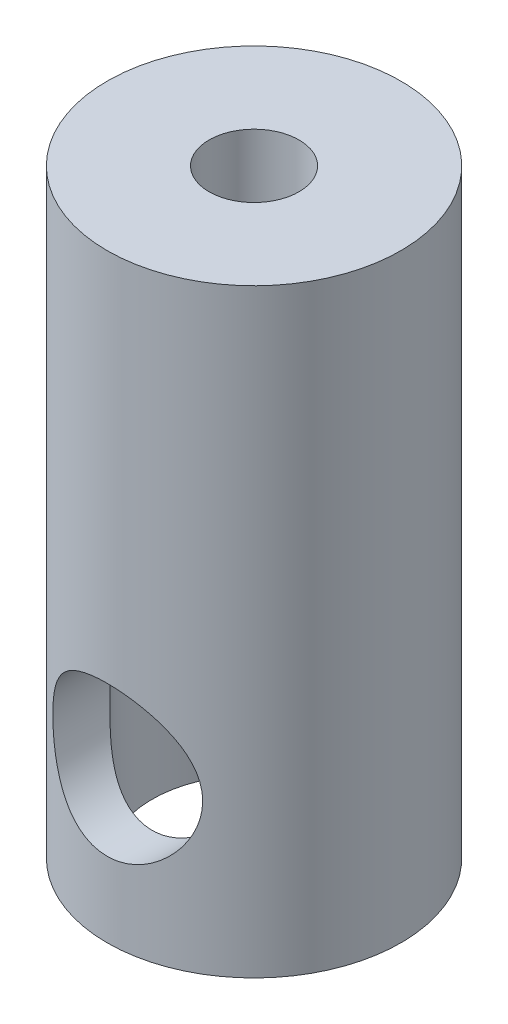
ISO-10303-21;
HEADER;
FILE_DESCRIPTION(('STEP AP214'),'2;1');
FILE_NAME('part.step','',(''),(''),'','','');
FILE_SCHEMA(('AUTOMOTIVE_DESIGN { 1 0 10303 214 1 1 1 1 }'));
ENDSEC;
DATA;
#1=APPLICATION_CONTEXT('core data for automotive mechanical design processes');
#2=APPLICATION_PROTOCOL_DEFINITION('international standard','automotive_design',2000,#1);
#3=PRODUCT_CONTEXT('',#1,'mechanical');
#4=PRODUCT('Part','Part','',(#3));
#5=PRODUCT_RELATED_PRODUCT_CATEGORY('part','',(#4));
#6=PRODUCT_DEFINITION_FORMATION('','',#4);
#7=PRODUCT_DEFINITION_CONTEXT('part definition',#1,'design');
#8=PRODUCT_DEFINITION('design','',#6,#7);
#9=PRODUCT_DEFINITION_SHAPE('','',#8);
#10=(LENGTH_UNIT() NAMED_UNIT(*) SI_UNIT(.MILLI.,.METRE.));
#11=(NAMED_UNIT(*) PLANE_ANGLE_UNIT() SI_UNIT($,.RADIAN.));
#12=(NAMED_UNIT(*) SI_UNIT($,.STERADIAN.) SOLID_ANGLE_UNIT());
#13=UNCERTAINTY_MEASURE_WITH_UNIT(LENGTH_MEASURE(1.E-05),#10,'distance_accuracy_value','');
#14=(GEOMETRIC_REPRESENTATION_CONTEXT(3) GLOBAL_UNCERTAINTY_ASSIGNED_CONTEXT((#13)) GLOBAL_UNIT_ASSIGNED_CONTEXT((#10,
#11,#12)) REPRESENTATION_CONTEXT('',''));
#15=CARTESIAN_POINT('',(0.,0.,0.));
#16=DIRECTION('',(0.,0.,1.));
#17=DIRECTION('',(1.,0.,0.));
#18=AXIS2_PLACEMENT_3D('',#15,#16,#17);
#19=CARTESIAN_POINT('',(0.,20.,0.));
#20=DIRECTION('',(0.,-1.,0.));
#21=DIRECTION('',(0.,0.,-1.));
#22=AXIS2_PLACEMENT_3D('',#19,#20,#21);
#23=CYLINDRICAL_SURFACE('',#22,4.9);
#24=CARTESIAN_POINT('',(0.,7.5,-4.9));
#25=CARTESIAN_POINT('',(-0.131102652298696,7.49999008015828,-4.89999150021614));
#26=CARTESIAN_POINT('',(-0.262357712688365,7.48962586794151,-4.89468191817214));
#27=CARTESIAN_POINT('',(-0.52096503000328,7.44863350988151,-4.87396208904623));
#28=CARTESIAN_POINT('',(-0.648309851416166,7.41796899096485,-4.85853371207637));
#29=CARTESIAN_POINT('',(-0.894969151195229,7.33790003419656,-4.81918761769867));
#30=CARTESIAN_POINT('',(-1.01431310235014,7.28856939491437,-4.79530335519683));
#31=CARTESIAN_POINT('',(-1.24284216969761,7.1729606202327,-4.74121855148949));
#32=CARTESIAN_POINT('',(-1.35202781921645,7.10668337524134,-4.71101834215149));
#33=CARTESIAN_POINT('',(-1.56478345456088,6.95438480613962,-4.64484918611168));
#34=CARTESIAN_POINT('',(-1.66758105411383,6.86739141510747,-4.60863819354479));
#35=CARTESIAN_POINT('',(-1.85784444956983,6.67822207730098,-4.53528738862471));
#36=CARTESIAN_POINT('',(-1.94529804247711,6.5760341646602,-4.49814686360049));
#37=CARTESIAN_POINT('',(-2.1095516512809,6.34942577266918,-4.42363791355028));
#38=CARTESIAN_POINT('',(-2.18490023866725,6.22387158890251,-4.38649814319471));
#39=CARTESIAN_POINT('',(-2.31310960531121,5.95968229609278,-4.32027550661961));
#40=CARTESIAN_POINT('',(-2.36598690774833,5.82105689031127,-4.29118672599933));
#41=CARTESIAN_POINT('',(-2.42524999141836,5.61079256026364,-4.25777159258246));
#42=CARTESIAN_POINT('',(-2.44142528054393,5.54257195717528,-4.24849077097913));
#43=CARTESIAN_POINT('',(-2.46802593614418,5.40468131512094,-4.23309450239287));
#44=CARTESIAN_POINT('',(-2.47845441500995,5.33501208197194,-4.22697734212637));
#45=CARTESIAN_POINT('',(-2.49338877307111,5.19487027841088,-4.21818549297126));
#46=CARTESIAN_POINT('',(-2.49789857748275,5.12439827170835,-4.2155085226015));
#47=CARTESIAN_POINT('',(-2.50094134148952,4.98330253136894,-4.21370255968994));
#48=CARTESIAN_POINT('',(-2.49947491443463,4.9126788140459,-4.21457320305098));
#49=CARTESIAN_POINT('',(-2.48723939583854,4.71933041488839,-4.22182011189786));
#50=CARTESIAN_POINT('',(-2.47034384168702,4.59706235681099,-4.23182067935606));
#51=CARTESIAN_POINT('',(-2.41914054483304,4.35749875739561,-4.26129079107976));
#52=CARTESIAN_POINT('',(-2.38482685714162,4.24020492863381,-4.28076356821355));
#53=CARTESIAN_POINT('',(-2.29917310550108,4.01046600094954,-4.32738054154234));
#54=CARTESIAN_POINT('',(-2.24745702968952,3.8981961708528,-4.35469200075449));
#55=CARTESIAN_POINT('',(-2.12875712867982,3.68338499479692,-4.41393101743737));
#56=CARTESIAN_POINT('',(-2.06176644076573,3.58084805113469,-4.44586064743659));
#57=CARTESIAN_POINT('',(-1.90405898389105,3.37407572616987,-4.51585462693925));
#58=CARTESIAN_POINT('',(-1.81137312344581,3.27142184874841,-4.55417067784262));
#59=CARTESIAN_POINT('',(-1.60998312787921,3.0824402753642,-4.62920132901846));
#60=CARTESIAN_POINT('',(-1.50127077489023,2.99612100742752,-4.66591509509885));
#61=CARTESIAN_POINT('',(-1.26402650028964,2.83816442934539,-4.73584885094046));
#62=CARTESIAN_POINT('',(-1.13477363316826,2.76748158354582,-4.7688009630896));
#63=CARTESIAN_POINT('',(-0.864107622919991,2.64945461613472,-4.82518016182554));
#64=CARTESIAN_POINT('',(-0.722704618545417,2.60209125336767,-4.84861509832962));
#65=CARTESIAN_POINT('',(-0.444641444211121,2.53607129558748,-4.88161901283628));
#66=CARTESIAN_POINT('',(-0.308600801996575,2.51531572151679,-4.89219780812759));
#67=CARTESIAN_POINT('',(-0.0345777414460422,2.49647533012025,-4.90179159980354));
#68=CARTESIAN_POINT('',(0.103403664154692,2.4983790971959,-4.90081241900803));
#69=CARTESIAN_POINT('',(0.365429928996525,2.52363781554579,-4.88797259858707));
#70=CARTESIAN_POINT('',(0.489694743405401,2.54523346381712,-4.87700448302806));
#71=CARTESIAN_POINT('',(0.73257147510304,2.60646113198664,-4.84647561894623));
#72=CARTESIAN_POINT('',(0.851182778853576,2.64609510456416,-4.82691394016353));
#73=CARTESIAN_POINT('',(1.0832037700839,2.74324757179506,-4.78027918729632));
#74=CARTESIAN_POINT('',(1.19637895507777,2.80123026813094,-4.75301338023263));
#75=CARTESIAN_POINT('',(1.41175496158453,2.93290083011999,-4.69355411752294));
#76=CARTESIAN_POINT('',(1.51395117700321,3.00659524903922,-4.66135860731106));
#77=CARTESIAN_POINT('',(1.7154484286298,3.17618860860642,-4.59126713232882));
#78=CARTESIAN_POINT('',(1.81340940773677,3.27358004232088,-4.55312402478183));
#79=CARTESIAN_POINT('',(1.99222933590515,3.48340997080642,-4.47777370357863));
#80=CARTESIAN_POINT('',(2.07307524371962,3.59585983396809,-4.44056722249131));
#81=CARTESIAN_POINT('',(2.21951562424596,3.84021385582399,-4.36929559836765));
#82=CARTESIAN_POINT('',(2.28405262856097,3.97284007623626,-4.3355080277572));
#83=CARTESIAN_POINT('',(2.3892042499517,4.24933250904368,-4.27847304974526));
#84=CARTESIAN_POINT('',(2.42985085697898,4.39318339737361,-4.2552115572668));
#85=CARTESIAN_POINT('',(2.48222192367224,4.67313993221276,-4.22485615107714));
#86=CARTESIAN_POINT('',(2.49637101097133,4.80864181732529,-4.21641195028441));
#87=CARTESIAN_POINT('',(2.50239518517034,5.08028820134129,-4.21284285082868));
#88=CARTESIAN_POINT('',(2.49428134480474,5.2164323471842,-4.21771133093983));
#89=CARTESIAN_POINT('',(2.4582989649427,5.47068782334618,-4.23876327339093));
#90=CARTESIAN_POINT('',(2.43254913715703,5.58921316146963,-4.25373085131167));
#91=CARTESIAN_POINT('',(2.36472303465325,5.8201057218987,-4.29180480798716));
#92=CARTESIAN_POINT('',(2.32264131909109,5.93247087773443,-4.31491389878808));
#93=CARTESIAN_POINT('',(2.22021963226766,6.15618385429048,-4.36854314647666));
#94=CARTESIAN_POINT('',(2.15884792911155,6.26696249541113,-4.3994551960667));
#95=CARTESIAN_POINT('',(2.02069478652338,6.47738127087035,-4.46459707638956));
#96=CARTESIAN_POINT('',(1.94390517812751,6.57701545671366,-4.49882866093989));
#97=CARTESIAN_POINT('',(1.76554000688713,6.77563606716565,-4.57201177210261));
#98=CARTESIAN_POINT('',(1.66204795310977,6.87289684507918,-4.61100500160705));
#99=CARTESIAN_POINT('',(1.43923745871025,7.04909612000481,-4.68533991534491));
#100=CARTESIAN_POINT('',(1.31991009877848,7.12802422163257,-4.72067952155201));
#101=CARTESIAN_POINT('',(1.06633126852765,7.26581843938045,-4.78436400326236));
#102=CARTESIAN_POINT('',(0.931920434478263,7.32443706157824,-4.8126215014743));
#103=CARTESIAN_POINT('',(0.723252974851705,7.39422237837027,-4.84684524527728));
#104=CARTESIAN_POINT('',(0.652572188551716,7.4144528093548,-4.85688869845866));
#105=CARTESIAN_POINT('',(0.509374061058256,7.4486615145743,-4.87398386949132));
#106=CARTESIAN_POINT('',(0.436857838363692,7.46264350403454,-4.88103736499577));
#107=CARTESIAN_POINT('',(0.303663142155398,7.48223273074961,-4.89095310742346));
#108=CARTESIAN_POINT('',(0.243175168938627,7.48888767234674,-4.89433791552391));
#109=CARTESIAN_POINT('',(0.12180243937707,7.49777367025535,-4.89886336629071));
#110=CARTESIAN_POINT('',(0.0609176725589145,7.5000046093169,-4.90000394947807));
#111=CARTESIAN_POINT('',(0.,7.5,-4.9));
#112=B_SPLINE_CURVE_WITH_KNOTS('',3,(#24,#25,#26,#27,#28,#29,#30,#31,#32,#33,#34,#35,#36,#37,
#38,#39,#40,#41,#42,#43,#44,#45,#46,#47,#48,#49,#50,#51,#52,#53,#54,#55,#56,#57,#58,#59,#60,#61,
#62,#63,#64,#65,#66,#67,#68,#69,#70,#71,#72,#73,#74,#75,#76,#77,#78,#79,#80,#81,#82,#83,#84,#85,
#86,#87,#88,#89,#90,#91,#92,#93,#94,#95,#96,#97,#98,#99,#100,#101,#102,#103,#104,#105,#106,#107,
#108,#109,#110,#111),.UNSPECIFIED.,.T.,.F.,(4,2,2,2,2,2,2,2,2,2,2,2,2,2,2,2,2,2,2,2,2,2,2,2,2,2,
2,2,2,2,2,2,2,2,2,2,2,2,2,2,2,2,2,4),(0.,0.39307135131447,0.786848901295492,1.17908560501904,
1.57130170408513,1.98792733340472,2.40488281530266,2.85585821158504,3.30650142860796,
3.5184092920036,3.73020227602462,3.94185472958208,4.15348546146404,4.52307497241866,
4.89279071299523,5.27107113838475,5.64952185709785,6.07821202406565,6.50712277905264,
6.95756305469321,7.40763104176386,7.81941918899943,8.23099988937787,8.60906728519562,
8.98717561719088,9.37573854122207,9.76446385071028,10.1925352259697,10.6209316159094,
11.0724282533468,11.5233189378736,11.9304384285358,12.337355470138,12.7023999789082,
13.0675662040124,13.4571214621235,13.8468836679655,14.2866891000661,14.7267433144706,
15.1719856031355,15.3943059066381,15.6164938455278,15.7991320825112,15.9817751599153),.UNSPECIFIED.);
#113=CARTESIAN_POINT('',(0.,7.5,-4.9));
#114=VERTEX_POINT('',#113);
#115=EDGE_CURVE('E78',#114,#114,#112,.T.);
#116=ORIENTED_EDGE('',*,*,#115,.T.);
#117=EDGE_LOOP('',(#116));
#118=FACE_BOUND('',#117,.T.);
#119=CARTESIAN_POINT('',(2.5,5.,4.21426150114109));
#120=CARTESIAN_POINT('',(2.49998909711374,4.87015192973058,4.21427504772392));
#121=CARTESIAN_POINT('',(2.48981467832206,4.74014399026072,4.22035545337756));
#122=CARTESIAN_POINT('',(2.44964768720088,4.4841551596962,4.24378723146864));
#123=CARTESIAN_POINT('',(2.41961518371928,4.35818291991352,4.2611613123276));
#124=CARTESIAN_POINT('',(2.34138866135179,4.11445241021373,4.30463361083964));
#125=CARTESIAN_POINT('',(2.29329434277353,3.99665317950001,4.33068384881081));
#126=CARTESIAN_POINT('',(2.18061399420421,3.77082712390024,4.38849869258697));
#127=CARTESIAN_POINT('',(2.11602650148344,3.66280116692766,4.42026380515304));
#128=CARTESIAN_POINT('',(1.96567818427594,3.44932721045434,4.48926656606219));
#129=CARTESIAN_POINT('',(1.8785733507101,3.34490154107791,4.52673991821611));
#130=CARTESIAN_POINT('',(1.68845397975901,3.15134104248378,4.60103724989819));
#131=CARTESIAN_POINT('',(1.58543127296418,3.06221411478582,4.63786088510345));
#132=CARTESIAN_POINT('',(1.3574803375062,2.8955881690578,4.70983054697504));
#133=CARTESIAN_POINT('',(1.23151686902511,2.81936164014867,4.74467251264461));
#134=CARTESIAN_POINT('',(0.966442527063615,2.68965021189097,4.80566646355895));
#135=CARTESIAN_POINT('',(0.82734036040022,2.63615037936497,4.83182415256107));
#136=CARTESIAN_POINT('',(0.550781065464521,2.55750984277753,4.87079893470939));
#137=CARTESIAN_POINT('',(0.413956036508232,2.53057207967211,4.88445603082193));
#138=CARTESIAN_POINT('',(0.13710091066768,2.49988706830807,4.90003865703661));
#139=CARTESIAN_POINT('',(-0.00292709775320108,2.4961251181345,4.90197162449872));
#140=CARTESIAN_POINT('',(-0.268639043761018,2.51123972108718,4.89427267388394));
#141=CARTESIAN_POINT('',(-0.394474725488611,2.52809923984964,4.88567106692481));
#142=CARTESIAN_POINT('',(-0.641241009741436,2.58034753888906,4.8594452955121));
#143=CARTESIAN_POINT('',(-0.762171243085652,2.61573771099418,4.84182045333003));
#144=CARTESIAN_POINT('',(-0.99774984150304,2.70423228270457,4.79885798357783));
#145=CARTESIAN_POINT('',(-1.11229274079931,2.75756694868701,4.77342049313113));
#146=CARTESIAN_POINT('',(-1.33107112603638,2.88009732083089,4.71709967323372));
#147=CARTESIAN_POINT('',(-1.4353029597251,2.94929861847419,4.68621442485264));
#148=CARTESIAN_POINT('',(-1.64133325870481,3.10932391663655,4.61832266554126));
#149=CARTESIAN_POINT('',(-1.74190699789888,3.20159707587228,4.58101294975206));
#150=CARTESIAN_POINT('',(-1.92682754157329,3.40128842672335,4.50636219006147));
#151=CARTESIAN_POINT('',(-2.01116096962437,3.50871897770603,4.46902114556305));
#152=CARTESIAN_POINT('',(-2.16685929203167,3.74460449762369,4.39575067550711));
#153=CARTESIAN_POINT('',(-2.23694933354267,3.87399316261157,4.36009071120897));
#154=CARTESIAN_POINT('',(-2.35384589191192,4.1449466894336,4.29811921349405));
#155=CARTESIAN_POINT('',(-2.40067746738433,4.2864982532005,4.27179762770617));
#156=CARTESIAN_POINT('',(-2.46584893206241,4.56586686958809,4.23448987006577));
#157=CARTESIAN_POINT('',(-2.48617143986513,4.70307404198192,4.2224437309767));
#158=CARTESIAN_POINT('',(-2.50373812503612,4.97943172305254,4.2120569949557));
#159=CARTESIAN_POINT('',(-2.50100023004225,5.11858063816834,4.21370575131278));
#160=CARTESIAN_POINT('',(-2.47434366719609,5.37760583714178,4.22939605200405));
#161=CARTESIAN_POINT('',(-2.45292280703375,5.49784297024877,4.24197550669122));
#162=CARTESIAN_POINT('',(-2.39327146820204,5.73276706193348,4.27591161694541));
#163=CARTESIAN_POINT('',(-2.35503524504566,5.84745210892431,4.29727127185336));
#164=CARTESIAN_POINT('',(-2.2610133457402,6.07403866221691,4.34750169210345));
#165=CARTESIAN_POINT('',(-2.20450162345378,6.18556975691943,4.37667264467607));
#166=CARTESIAN_POINT('',(-2.07615694702754,6.39821858957548,4.43899308181744));
#167=CARTESIAN_POINT('',(-2.00431610028428,6.49933092323433,4.47214461203183));
#168=CARTESIAN_POINT('',(-1.83625364706037,6.70227646504266,4.54396036281023));
#169=CARTESIAN_POINT('',(-1.73806379221128,6.80243464019763,4.58277357555826));
#170=CARTESIAN_POINT('',(-1.52571532884939,6.9854072059004,4.65777542652965));
#171=CARTESIAN_POINT('',(-1.41155063057155,7.06821495209058,4.69396305582884));
#172=CARTESIAN_POINT('',(-1.16577891734047,7.21633753280155,4.76105601901679));
#173=CARTESIAN_POINT('',(-1.03374456456817,7.28103846198746,4.79176546965701));
#174=CARTESIAN_POINT('',(-0.758647601241392,7.3866515889709,4.84292863283769));
#175=CARTESIAN_POINT('',(-0.615595195485001,7.42758550642893,4.86339170674464));
#176=CARTESIAN_POINT('',(-0.337046782403884,7.48084265940244,4.89020558302278));
#177=CARTESIAN_POINT('',(-0.202105946302589,7.49549518667461,4.8977029025419));
#178=CARTESIAN_POINT('',(0.0684998345183518,7.50271943675598,4.90138631163701));
#179=CARTESIAN_POINT('',(0.204164483998307,7.49529956398356,4.89757670650617));
#180=CARTESIAN_POINT('',(0.462290876745441,7.46009387198617,4.87973993887716));
#181=CARTESIAN_POINT('',(0.585009850016969,7.43377814964329,4.86645075251913));
#182=CARTESIAN_POINT('',(0.824070221944595,7.36356417220447,4.83171883529052));
#183=CARTESIAN_POINT('',(0.940410738325669,7.31966349167886,4.81027497969659));
#184=CARTESIAN_POINT('',(1.16885610340157,7.21365981113656,4.76004459600471));
#185=CARTESIAN_POINT('',(1.28058487049192,7.1508770920406,4.73099030513204));
#186=CARTESIAN_POINT('',(1.49236952384668,7.0097387211311,4.66851627489929));
#187=CARTESIAN_POINT('',(1.59242007147337,6.93137599090353,4.63509455367349));
#188=CARTESIAN_POINT('',(1.78889058349126,6.75195218982474,4.56310323735356));
#189=CARTESIAN_POINT('',(1.8838748466509,6.64938445495242,4.52435800486013));
#190=CARTESIAN_POINT('',(2.05584799166643,6.42934645625388,4.44885680284778));
#191=CARTESIAN_POINT('',(2.13281979936811,6.31186221432844,4.41210274593264));
#192=CARTESIAN_POINT('',(2.26916851023631,6.0593235851828,4.34361022597075));
#193=CARTESIAN_POINT('',(2.32776501046524,5.92377094048683,4.31211564461601));
#194=CARTESIAN_POINT('',(2.39726670816662,5.71315335301388,4.27361684380307));
#195=CARTESIAN_POINT('',(2.41735864835945,5.64179985149757,4.26224736767689));
#196=CARTESIAN_POINT('',(2.45118782204259,5.49717129953642,4.2428837462417));
#197=CARTESIAN_POINT('',(2.46492943179751,5.42389760927744,4.23488727679249));
#198=CARTESIAN_POINT('',(2.48355396394084,5.29218497612005,4.22398495009512));
#199=CARTESIAN_POINT('',(2.48971314318996,5.23398315921378,4.22035041591368));
#200=CARTESIAN_POINT('',(2.49793875796396,5.11719843742904,4.21548555404651));
#201=CARTESIAN_POINT('',(2.50000492173823,5.05861550750612,4.21425538599571));
#202=CARTESIAN_POINT('',(2.5,5.,4.21426150114109));
#203=B_SPLINE_CURVE_WITH_KNOTS('',3,(#119,#120,#121,#122,#123,#124,#125,#126,#127,#128,#129,
#130,#131,#132,#133,#134,#135,#136,#137,#138,#139,#140,#141,#142,#143,#144,#145,#146,#147,#148,
#149,#150,#151,#152,#153,#154,#155,#156,#157,#158,#159,#160,#161,#162,#163,#164,#165,#166,#167,
#168,#169,#170,#171,#172,#173,#174,#175,#176,#177,#178,#179,#180,#181,#182,#183,#184,#185,#186,
#187,#188,#189,#190,#191,#192,#193,#194,#195,#196,#197,#198,#199,#200,#201,#202),.UNSPECIFIED.,
.T.,.F.,(4,2,2,2,2,2,2,2,2,2,2,2,2,2,2,2,2,2,2,2,2,2,2,2,2,2,2,2,2,2,2,2,2,2,2,2,2,2,2,2,2,4),
(0.,0.389306677375365,0.779398573108191,1.16736809687359,1.55537204043931,1.97677485845844,
2.39839467267755,2.84990813433337,3.30112445648769,3.71913932701795,4.13688899639015,
4.51685018287995,4.89683991216013,5.28190451574855,5.66710502720356,6.08980532115208,
6.51285229940579,6.96471898516144,7.4160977689653,7.83130161833055,8.24618270937919,
8.61286158485957,8.97966582309766,9.36333466939839,9.74720153644406,10.1818629275634,
10.6166904695301,11.0648446304717,11.5125885951631,11.9182108034108,12.323678584304,
12.7006097627323,13.0775929478256,13.4702191423999,13.8630241268203,14.2962931270285,
14.7299711777607,15.1801410035293,15.4048239748005,15.6293518763706,15.8050795056533,
15.9808188017594),.UNSPECIFIED.);
#204=CARTESIAN_POINT('',(2.5,5.,4.21426150114109));
#205=VERTEX_POINT('',#204);
#206=EDGE_CURVE('E73',#205,#205,#203,.T.);
#207=ORIENTED_EDGE('',*,*,#206,.T.);
#208=EDGE_LOOP('',(#207));
#209=FACE_BOUND('',#208,.T.);
#210=CARTESIAN_POINT('',(0.,20.,0.));
#211=DIRECTION('',(0.,1.,0.));
#212=DIRECTION('',(0.,0.,1.));
#213=AXIS2_PLACEMENT_3D('',#210,#211,#212);
#214=CIRCLE('',#213,4.9);
#215=CARTESIAN_POINT('',(0.,20.,4.9));
#216=VERTEX_POINT('',#215);
#217=EDGE_CURVE('E10',#216,#216,#214,.T.);
#218=ORIENTED_EDGE('',*,*,#217,.F.);
#219=EDGE_LOOP('',(#218));
#220=FACE_BOUND('',#219,.T.);
#221=CARTESIAN_POINT('',(0.,0.,0.));
#222=DIRECTION('',(0.,1.,0.));
#223=DIRECTION('',(0.,0.,1.));
#224=AXIS2_PLACEMENT_3D('',#221,#222,#223);
#225=CIRCLE('',#224,4.9);
#226=CARTESIAN_POINT('',(0.,0.,4.9));
#227=VERTEX_POINT('',#226);
#228=EDGE_CURVE('E43',#227,#227,#225,.T.);
#229=ORIENTED_EDGE('',*,*,#228,.T.);
#230=EDGE_LOOP('',(#229));
#231=FACE_BOUND('',#230,.T.);
#232=ADVANCED_FACE('F30',(#118,#209,#220,#231),#23,.T.);
#233=CARTESIAN_POINT('',(0.,20.,0.));
#234=DIRECTION('',(0.,1.,0.));
#235=DIRECTION('',(0.,0.,1.));
#236=AXIS2_PLACEMENT_3D('',#233,#234,#235);
#237=PLANE('',#236);
#238=CARTESIAN_POINT('',(0.,20.,0.));
#239=DIRECTION('',(0.,1.,0.));
#240=DIRECTION('',(0.,0.,1.));
#241=AXIS2_PLACEMENT_3D('',#238,#239,#240);
#242=CIRCLE('',#241,1.5);
#243=CARTESIAN_POINT('',(0.,20.,1.5));
#244=VERTEX_POINT('',#243);
#245=EDGE_CURVE('E51',#244,#244,#242,.T.);
#246=ORIENTED_EDGE('',*,*,#245,.F.);
#247=EDGE_LOOP('',(#246));
#248=FACE_BOUND('',#247,.T.);
#249=ORIENTED_EDGE('',*,*,#217,.T.);
#250=EDGE_LOOP('',(#249));
#251=FACE_BOUND('',#250,.T.);
#252=ADVANCED_FACE('F97',(#248,#251),#237,.T.);
#253=CARTESIAN_POINT('',(0.,0.,0.));
#254=DIRECTION('',(0.,1.,0.));
#255=DIRECTION('',(0.,0.,1.));
#256=AXIS2_PLACEMENT_3D('',#253,#254,#255);
#257=PLANE('',#256);
#258=CARTESIAN_POINT('',(0.,0.,0.));
#259=DIRECTION('',(0.,-1.,0.));
#260=DIRECTION('',(0.,0.,-1.));
#261=AXIS2_PLACEMENT_3D('',#258,#259,#260);
#262=CIRCLE('',#261,3.4);
#263=CARTESIAN_POINT('',(0.,0.,-3.4));
#264=VERTEX_POINT('',#263);
#265=EDGE_CURVE('E84',#264,#264,#262,.T.);
#266=ORIENTED_EDGE('',*,*,#265,.F.);
#267=EDGE_LOOP('',(#266));
#268=FACE_BOUND('',#267,.T.);
#269=ORIENTED_EDGE('',*,*,#228,.F.);
#270=EDGE_LOOP('',(#269));
#271=FACE_BOUND('',#270,.T.);
#272=ADVANCED_FACE('F99',(#268,#271),#257,.F.);
#273=CARTESIAN_POINT('',(0.,15.,0.));
#274=DIRECTION('',(0.,1.,0.));
#275=DIRECTION('',(0.,0.,1.));
#276=AXIS2_PLACEMENT_3D('',#273,#274,#275);
#277=CYLINDRICAL_SURFACE('',#276,1.5);
#278=CARTESIAN_POINT('',(0.,15.,0.));
#279=DIRECTION('',(0.,1.,0.));
#280=DIRECTION('',(0.,0.,1.));
#281=AXIS2_PLACEMENT_3D('',#278,#279,#280);
#282=CIRCLE('',#281,1.5);
#283=CARTESIAN_POINT('',(0.,15.,1.5));
#284=VERTEX_POINT('',#283);
#285=EDGE_CURVE('E48',#284,#284,#282,.T.);
#286=ORIENTED_EDGE('',*,*,#285,.F.);
#287=EDGE_LOOP('',(#286));
#288=FACE_BOUND('',#287,.T.);
#289=ORIENTED_EDGE('',*,*,#245,.T.);
#290=EDGE_LOOP('',(#289));
#291=FACE_BOUND('',#290,.T.);
#292=ADVANCED_FACE('F95',(#288,#291),#277,.F.);
#293=CARTESIAN_POINT('',(0.,15.,0.));
#294=DIRECTION('',(0.,1.,0.));
#295=DIRECTION('',(0.,0.,1.));
#296=AXIS2_PLACEMENT_3D('',#293,#294,#295);
#297=PLANE('',#296);
#298=ORIENTED_EDGE('',*,*,#285,.T.);
#299=EDGE_LOOP('',(#298));
#300=FACE_BOUND('',#299,.T.);
#301=ADVANCED_FACE('F109',(#300),#297,.T.);
#302=CARTESIAN_POINT('',(0.,10.,0.));
#303=DIRECTION('',(0.,-1.,0.));
#304=DIRECTION('',(0.,0.,-1.));
#305=AXIS2_PLACEMENT_3D('',#302,#303,#304);
#306=CYLINDRICAL_SURFACE('',#305,3.4);
#307=CARTESIAN_POINT('',(0.,7.5,-3.4));
#308=CARTESIAN_POINT('',(0.122639453712852,7.49999175452848,-3.39999211705024));
#309=CARTESIAN_POINT('',(0.245474082394141,7.49090343170284,-3.39329422519441));
#310=CARTESIAN_POINT('',(0.487295182166906,7.45511006653816,-3.36710883659077));
#311=CARTESIAN_POINT('',(0.606271411349532,7.42836161542875,-3.3475898260123));
#312=CARTESIAN_POINT('',(0.836236441382396,7.35903554446752,-3.29764692922757));
#313=CARTESIAN_POINT('',(0.94726824593285,7.31655229548973,-3.26728809411914));
#314=CARTESIAN_POINT('',(1.15993305562516,7.2177285366084,-3.19798086123829));
#315=CARTESIAN_POINT('',(1.26156871034205,7.16139194964128,-3.15903489545954));
#316=CARTESIAN_POINT('',(1.46316688278729,7.0309734726081,-3.07120651147429));
#317=CARTESIAN_POINT('',(1.56212445825414,6.95573920997308,-3.02174084431108));
#318=CARTESIAN_POINT('',(1.74687761937436,6.79266115797116,-2.91884038296373));
#319=CARTESIAN_POINT('',(1.83265221711845,6.70479768393423,-2.86539945662962));
#320=CARTESIAN_POINT('',(2.00584127861669,6.49934837222899,-2.74764820921147));
#321=CARTESIAN_POINT('',(2.09030333839102,6.37930920467007,-2.68325377284346));
#322=CARTESIAN_POINT('',(2.23808911823127,6.12369277126519,-2.56126897338323));
#323=CARTESIAN_POINT('',(2.30144395063511,5.98813877432624,-2.50366867732259));
#324=CARTESIAN_POINT('',(2.38689317818604,5.75027839638255,-2.42177824648064));
#325=CARTESIAN_POINT('',(2.41570030426964,5.65202280730781,-2.39279122475066));
#326=CARTESIAN_POINT('',(2.46127545175348,5.45029640398008,-2.34589081101777));
#327=CARTESIAN_POINT('',(2.47807066274562,5.34683793899396,-2.32795242272986));
#328=CARTESIAN_POINT('',(2.49853712705971,5.13625125831133,-2.30598492489725));
#329=CARTESIAN_POINT('',(2.50210457037965,5.02910064837284,-2.30206584568856));
#330=CARTESIAN_POINT('',(2.49548631703967,4.81570481178578,-2.30923389601594));
#331=CARTESIAN_POINT('',(2.48529149032212,4.70946023327983,-2.3203309874743));
#332=CARTESIAN_POINT('',(2.45025865013458,4.49024300253848,-2.35731223801297));
#333=CARTESIAN_POINT('',(2.42397761591024,4.37775778441774,-2.38464451072151));
#334=CARTESIAN_POINT('',(2.35752736278153,4.16032210762177,-2.45035394445972));
#335=CARTESIAN_POINT('',(2.31732519086408,4.05539024698226,-2.48875727556874));
#336=CARTESIAN_POINT('',(2.20817362067681,3.81824847335492,-2.58670600394509));
#337=CARTESIAN_POINT('',(2.13408574127448,3.68952187318729,-2.64892441285211));
#338=CARTESIAN_POINT('',(1.96541442079028,3.44794455392281,-2.77639571848056));
#339=CARTESIAN_POINT('',(1.87080729378014,3.33511243263333,-2.84165205301822));
#340=CARTESIAN_POINT('',(1.66053554829893,3.12516697261782,-2.96951145922357));
#341=CARTESIAN_POINT('',(1.54458449463369,3.02830630922785,-3.03206209177189));
#342=CARTESIAN_POINT('',(1.29383496440729,2.85546052790343,-3.14720771748161));
#343=CARTESIAN_POINT('',(1.15908065370848,2.77942769421124,-3.19982537917574));
#344=CARTESIAN_POINT('',(0.910038898867523,2.66861281731659,-3.277843192411));
#345=CARTESIAN_POINT('',(0.799330390327152,2.62825407799734,-3.30676259858829));
#346=CARTESIAN_POINT('',(0.571173319783577,2.56324099543284,-3.35369681790778));
#347=CARTESIAN_POINT('',(0.453729818605247,2.53857502457115,-3.37171970437442));
#348=CARTESIAN_POINT('',(0.214777278050331,2.50631665786963,-3.39534010240707));
#349=CARTESIAN_POINT('',(0.0932539839480527,2.49879224309578,-3.40088813930087));
#350=CARTESIAN_POINT('',(-0.149486956120126,2.50152398161631,-3.39887934590761));
#351=CARTESIAN_POINT('',(-0.270704602817255,2.51178009233223,-3.39132254700229));
#352=CARTESIAN_POINT('',(-0.50154148617654,2.54821087841568,-3.36468869730153));
#353=CARTESIAN_POINT('',(-0.611413856524022,2.5733591427163,-3.34635497623395));
#354=CARTESIAN_POINT('',(-0.824946228506733,2.63739564423336,-3.30021328951015));
#355=CARTESIAN_POINT('',(-0.92860492131585,2.67628676438223,-3.27240333600387));
#356=CARTESIAN_POINT('',(-1.13575967414636,2.76976183705467,-3.20667581016525));
#357=CARTESIAN_POINT('',(-1.23860740347463,2.82533614597711,-3.16813728420423));
#358=CARTESIAN_POINT('',(-1.43380088066495,2.94876347833374,-3.08472078122561));
#359=CARTESIAN_POINT('',(-1.52614025039327,3.01662389486805,-3.03983899076905));
#360=CARTESIAN_POINT('',(-1.71556830859362,3.17657134812268,-2.93775649893076));
#361=CARTESIAN_POINT('',(-1.81042690573907,3.27081913096644,-2.87980545554425));
#362=CARTESIAN_POINT('',(-1.98392361561489,3.47297077730333,-2.76314626460844));
#363=CARTESIAN_POINT('',(-2.06254606246813,3.58088766935358,-2.70443744337947));
#364=CARTESIAN_POINT('',(-2.1958990080901,3.79884417470918,-2.59704522367162));
#365=CARTESIAN_POINT('',(-2.25218527629066,3.90771922055797,-2.54793871886967));
#366=CARTESIAN_POINT('',(-2.34909327540433,4.13569294955227,-2.4588801982764));
#367=CARTESIAN_POINT('',(-2.3897474703602,4.25476980977286,-2.41890928091188));
#368=CARTESIAN_POINT('',(-2.44570573399455,4.47271549361255,-2.36214640743453));
#369=CARTESIAN_POINT('',(-2.4647204061729,4.56976603311565,-2.34211587946473));
#370=CARTESIAN_POINT('',(-2.4911078710363,4.76708527384632,-2.3140376865014));
#371=CARTESIAN_POINT('',(-2.49849904324315,4.86734863811188,-2.30597110481095));
#372=CARTESIAN_POINT('',(-2.5010892362277,5.06848686837523,-2.30316298449814));
#373=CARTESIAN_POINT('',(-2.49625726850778,5.16936264050015,-2.30845531374352));
#374=CARTESIAN_POINT('',(-2.47473729984862,5.36842271285694,-2.33150297837319));
#375=CARTESIAN_POINT('',(-2.45803313196261,5.46660315316318,-2.34927530797913));
#376=CARTESIAN_POINT('',(-2.40763170880221,5.68494841275167,-2.40102726696538));
#377=CARTESIAN_POINT('',(-2.37048076068488,5.80354881747431,-2.43815587436823));
#378=CARTESIAN_POINT('',(-2.28076570307147,6.03109193389919,-2.52227820920875));
#379=CARTESIAN_POINT('',(-2.22816100367945,6.14000821584781,-2.56929782223456));
#380=CARTESIAN_POINT('',(-2.09242220128414,6.37667265506142,-2.68170391603191));
#381=CARTESIAN_POINT('',(-2.00486499613214,6.50118952726378,-2.74855334256907));
#382=CARTESIAN_POINT('',(-1.80860951134632,6.73260270680217,-2.88149214194429));
#383=CARTESIAN_POINT('',(-1.69992245452908,6.83950831266796,-2.94758189862029));
#384=CARTESIAN_POINT('',(-1.48079202176642,7.01842191057153,-3.06269932926442));
#385=CARTESIAN_POINT('',(-1.373230395286,7.09327054173217,-3.11278398250573));
#386=CARTESIAN_POINT('',(-1.14477133458283,7.22641317401242,-3.20383436988517));
#387=CARTESIAN_POINT('',(-1.02388820553815,7.28472469740163,-3.24480974593832));
#388=CARTESIAN_POINT('',(-0.790378873715191,7.37455141315564,-3.30872546994658));
#389=CARTESIAN_POINT('',(-0.679293673680521,7.40879342684633,-3.33346106729267));
#390=CARTESIAN_POINT('',(-0.451743316203231,7.46160241667884,-3.3718171308517));
#391=CARTESIAN_POINT('',(-0.335292589013785,7.48020911291239,-3.38546575953321));
#392=CARTESIAN_POINT('',(-0.181701402051901,7.49365468546563,-3.39533682971588));
#393=CARTESIAN_POINT('',(-0.145430695376669,7.49603109706322,-3.39708256303395));
#394=CARTESIAN_POINT('',(-0.0727790658062967,7.49920508357043,-3.39941539550008));
#395=CARTESIAN_POINT('',(-0.0363981288124161,7.50000244717117,-3.40000233957843));
#396=CARTESIAN_POINT('',(0.,7.5,-3.4));
#397=B_SPLINE_CURVE_WITH_KNOTS('',3,(#307,#308,#309,#310,#311,#312,#313,#314,#315,#316,#317,
#318,#319,#320,#321,#322,#323,#324,#325,#326,#327,#328,#329,#330,#331,#332,#333,#334,#335,#336,
#337,#338,#339,#340,#341,#342,#343,#344,#345,#346,#347,#348,#349,#350,#351,#352,#353,#354,#355,
#356,#357,#358,#359,#360,#361,#362,#363,#364,#365,#366,#367,#368,#369,#370,#371,#372,#373,#374,
#375,#376,#377,#378,#379,#380,#381,#382,#383,#384,#385,#386,#387,#388,#389,#390,#391,#392,#393,
#394,#395,#396),.UNSPECIFIED.,.T.,.F.,(4,2,2,2,2,2,2,2,2,2,2,2,2,2,2,2,2,2,2,2,2,2,2,2,2,2,2,2,
2,2,2,2,2,2,2,2,2,2,2,2,2,2,2,2,4),(0.,0.367759901960342,0.736427143689062,1.10291816026764,
1.46930551456283,1.86923413612241,2.26979301031025,2.74859419814859,3.22668647139241,
3.54481569521832,3.8622225182054,4.18211510412075,4.50222001500284,4.85639437694127,
5.2114129090796,5.69203322513721,6.17321131543886,6.66139257793899,7.14844590021459,
7.51094218662744,7.87316956626226,8.23683100778248,8.60049157845535,8.94160444128861,
9.28278890421111,9.65068970251859,10.0188126234593,10.4543889576343,10.8903836254112,
11.2851720446903,11.6791360975802,11.980616148903,12.2816190074077,12.5833857424358,
12.885564197045,13.2725600249607,13.6605815421507,14.1569278807538,14.653011308852,
15.0722254107552,15.4909936509288,15.8460625226683,16.200226623817,16.3093593779939,
16.4185067353765),.UNSPECIFIED.);
#398=CARTESIAN_POINT('',(0.,7.5,-3.4));
#399=VERTEX_POINT('',#398);
#400=EDGE_CURVE('E34',#399,#399,#397,.T.);
#401=ORIENTED_EDGE('',*,*,#400,.T.);
#402=EDGE_LOOP('',(#401));
#403=FACE_BOUND('',#402,.T.);
#404=CARTESIAN_POINT('',(2.5,5.,2.30434372436058));
#405=CARTESIAN_POINT('',(2.50000042316284,5.05884733431959,2.30434287838199));
#406=CARTESIAN_POINT('',(2.49791610682938,5.1176895182058,2.30661130595505));
#407=CARTESIAN_POINT('',(2.4896462910983,5.23476095139236,2.31553336265675));
#408=CARTESIAN_POINT('',(2.48345884094918,5.29298989575693,2.32218907762294));
#409=CARTESIAN_POINT('',(2.45891750580862,5.46614739982674,2.34825882041641));
#410=CARTESIAN_POINT('',(2.4345852978337,5.57937158239357,2.37377377372134));
#411=CARTESIAN_POINT('',(2.37231600995589,5.79674618257343,2.43597687788503));
#412=CARTESIAN_POINT('',(2.33456011669293,5.90099551513213,2.47251528959457));
#413=CARTESIAN_POINT('',(2.24697643107934,6.10138378519494,2.55237504354853));
#414=CARTESIAN_POINT('',(2.19714947710405,6.19752328532898,2.59569591465468));
#415=CARTESIAN_POINT('',(2.07536072987795,6.39980488260258,2.69446955372847));
#416=CARTESIAN_POINT('',(2.00096824219562,6.50414170855752,2.75062308216351));
#417=CARTESIAN_POINT('',(1.83705254067315,6.70047941486944,2.86271786694989));
#418=CARTESIAN_POINT('',(1.74750828855878,6.79246281949955,2.91865871603299));
#419=CARTESIAN_POINT('',(1.53501738140197,6.97922371815069,3.03662928946304));
#420=CARTESIAN_POINT('',(1.4089588998006,7.07113167955657,3.09775871603038));
#421=CARTESIAN_POINT('',(1.2058764168925,7.19135846338056,3.17981395371409));
#422=CARTESIAN_POINT('',(1.13587489064021,7.22848563369727,3.20555239533067));
#423=CARTESIAN_POINT('',(0.991576491039897,7.29632934825801,3.25308140951058));
#424=CARTESIAN_POINT('',(0.917281787659162,7.3270490955315,3.27487395388038));
#425=CARTESIAN_POINT('',(0.733301513152467,7.39276933868374,3.32183886994435));
#426=CARTESIAN_POINT('',(0.62171612991609,7.42426210554943,3.34466513332854));
#427=CARTESIAN_POINT('',(0.393659958436482,7.47155359946011,3.37909954279304));
#428=CARTESIAN_POINT('',(0.277193413487108,7.48736567474602,3.39071722998216));
#429=CARTESIAN_POINT('',(0.042312163160249,7.50241550539516,3.40177246225338));
#430=CARTESIAN_POINT('',(-0.0761065354026206,7.50161352968369,3.40118080976234));
#431=CARTESIAN_POINT('',(-0.310959210166982,7.48338196811856,3.38779408444467));
#432=CARTESIAN_POINT('',(-0.427392685282037,7.46594824571315,3.37499597569909));
#433=CARTESIAN_POINT('',(-0.651435445719027,7.41627888965281,3.3388807976766));
#434=CARTESIAN_POINT('',(-0.759206046538166,7.38451553859872,3.31589974307605));
#435=CARTESIAN_POINT('',(-0.967561578393922,7.3078477865543,3.26120247414232));
#436=CARTESIAN_POINT('',(-1.06814500589544,7.26294064587768,3.22948443875755));
#437=CARTESIAN_POINT('',(-1.27130083928805,7.15601141806615,3.15542902279509));
#438=CARTESIAN_POINT('',(-1.37287812041903,7.09265119584473,3.11230787271654));
#439=CARTESIAN_POINT('',(-1.56446055825909,6.95358675139331,3.02055781351118));
#440=CARTESIAN_POINT('',(-1.6544548421823,6.87787108028439,2.97192380891658));
#441=CARTESIAN_POINT('',(-1.83842533656716,6.69987922776763,2.86246853531874));
#442=CARTESIAN_POINT('',(-1.92984602137779,6.59529481743537,2.80110068752131));
#443=CARTESIAN_POINT('',(-2.09465365320942,6.37175799197955,2.68008553067334));
#444=CARTESIAN_POINT('',(-2.16803588686417,6.25280183366751,2.62043867489614));
#445=CARTESIAN_POINT('',(-2.28173864631972,6.02763596864809,2.52152739074949));
#446=CARTESIAN_POINT('',(-2.32576809029336,5.92403188305795,2.48061768966063));
#447=CARTESIAN_POINT('',(-2.40010408260411,5.70879770174367,2.40877206199343));
#448=CARTESIAN_POINT('',(-2.43044157654357,5.59718637243799,2.37781369018254));
#449=CARTESIAN_POINT('',(-2.47160745831487,5.38787138356094,2.33492880930667));
#450=CARTESIAN_POINT('',(-2.48492400929634,5.2911609314254,2.32061691593276));
#451=CARTESIAN_POINT('',(-2.50007609203441,5.09584557395004,2.30429107905016));
#452=CARTESIAN_POINT('',(-2.50192304923868,4.99724265207309,2.3022648971648));
#453=CARTESIAN_POINT('',(-2.49401121382979,4.8011616324598,2.31082960128201));
#454=CARTESIAN_POINT('',(-2.48426085488086,4.70368276932255,2.32141131872557));
#455=CARTESIAN_POINT('',(-2.45387895784607,4.51224115951121,2.35349778657355));
#456=CARTESIAN_POINT('',(-2.43323004694019,4.41828428389839,2.37501997459212));
#457=CARTESIAN_POINT('',(-2.37202133794723,4.19933660042579,2.43639862800205));
#458=CARTESIAN_POINT('',(-2.32681803359789,4.07675244368535,2.48013930069593));
#459=CARTESIAN_POINT('',(-2.21979550788035,3.84278953923674,2.57637187851941));
#460=CARTESIAN_POINT('',(-2.15794272616842,3.73143405528239,2.62888137690992));
#461=CARTESIAN_POINT('',(-2.01682110784554,3.51695505369195,2.73873966391157));
#462=CARTESIAN_POINT('',(-1.93705667340494,3.41421084001524,2.7961897175669));
#463=CARTESIAN_POINT('',(-1.76217238190398,3.2219068160878,2.90957091521066));
#464=CARTESIAN_POINT('',(-1.66706409407925,3.13233716875942,2.96550316678793));
#465=CARTESIAN_POINT('',(-1.46406286962086,2.96945165471024,3.07072482265378));
#466=CARTESIAN_POINT('',(-1.356452525127,2.8958551261372,3.12012171449534));
#467=CARTESIAN_POINT('',(-1.1279937002341,2.7650750451342,3.20976983143056));
#468=CARTESIAN_POINT('',(-1.00714781981723,2.70788827714037,3.25002284798374));
#469=CARTESIAN_POINT('',(-0.817351042054997,2.63640374038206,3.30095630968705));
#470=CARTESIAN_POINT('',(-0.752313367134132,2.61488627721612,3.31641355085587));
#471=CARTESIAN_POINT('',(-0.619994675549274,2.5771234311117,3.34367433499222));
#472=CARTESIAN_POINT('',(-0.552714903982827,2.56087517411769,3.35547986959745));
#473=CARTESIAN_POINT('',(-0.416521151901345,2.53396616533252,3.37509079687968));
#474=CARTESIAN_POINT('',(-0.347608437089374,2.52330122499414,3.38289918807505));
#475=CARTESIAN_POINT('',(-0.208815069456507,2.50775594192772,3.39429734719711));
#476=CARTESIAN_POINT('',(-0.138934592506613,2.50287456175691,3.3978878717148));
#477=CARTESIAN_POINT('',(0.049827912216152,2.497686318076,3.40169882444226));
#478=CARTESIAN_POINT('',(0.169016407374375,2.50291553212891,3.39784348820178));
#479=CARTESIAN_POINT('',(0.404342508523217,2.53006729912535,3.37794130436363));
#480=CARTESIAN_POINT('',(0.520480084935776,2.55199001384737,3.36189433861559));
#481=CARTESIAN_POINT('',(0.743051360886223,2.61029344989925,3.31968487234087));
#482=CARTESIAN_POINT('',(0.849675259205158,2.64619854828088,3.29385583997275));
#483=CARTESIAN_POINT('',(1.05514191765113,2.73085092976532,3.23390576171377));
#484=CARTESIAN_POINT('',(1.15398343946491,2.77960025126834,3.199783399724));
#485=CARTESIAN_POINT('',(1.35474650256317,2.89530213224303,3.12053633847642));
#486=CARTESIAN_POINT('',(1.45544575997339,2.9637852509369,3.0745626967054));
#487=CARTESIAN_POINT('',(1.64456737798058,3.11321607436787,2.97770287908412));
#488=CARTESIAN_POINT('',(1.73297429428568,3.19417919476831,2.92681065706063));
#489=CARTESIAN_POINT('',(1.91282793649214,3.3840276933641,2.81326522986698));
#490=CARTESIAN_POINT('',(2.00154600241578,3.49528384974009,2.75024350271232));
#491=CARTESIAN_POINT('',(2.1596775956876,3.73267391091701,2.62788053721063));
#492=CARTESIAN_POINT('',(2.22909843857233,3.858802151846,2.56853791077125));
#493=CARTESIAN_POINT('',(2.33002530673422,4.08789128093297,2.47674405878351));
#494=CARTESIAN_POINT('',(2.3667041243114,4.18741477662661,2.44142050888217));
#495=CARTESIAN_POINT('',(2.42755364229644,4.39304554917354,2.38093289395697));
#496=CARTESIAN_POINT('',(2.4517620130603,4.4991319005575,2.3557382829703));
#497=CARTESIAN_POINT('',(2.47921781080835,4.67177011504201,2.32673448873935));
#498=CARTESIAN_POINT('',(2.48698535950757,4.73687211706743,2.3183955243512));
#499=CARTESIAN_POINT('',(2.49737638454301,4.86798486653792,2.30720043779367));
#500=CARTESIAN_POINT('',(2.49999952537225,4.93399567297051,2.30434467322679));
#501=CARTESIAN_POINT('',(2.5,5.,2.30434372436058));
#502=B_SPLINE_CURVE_WITH_KNOTS('',3,(#404,#405,#406,#407,#408,#409,#410,#411,#412,#413,#414,
#415,#416,#417,#418,#419,#420,#421,#422,#423,#424,#425,#426,#427,#428,#429,#430,#431,#432,#433,
#434,#435,#436,#437,#438,#439,#440,#441,#442,#443,#444,#445,#446,#447,#448,#449,#450,#451,#452,
#453,#454,#455,#456,#457,#458,#459,#460,#461,#462,#463,#464,#465,#466,#467,#468,#469,#470,#471,
#472,#473,#474,#475,#476,#477,#478,#479,#480,#481,#482,#483,#484,#485,#486,#487,#488,#489,#490,
#491,#492,#493,#494,#495,#496,#497,#498,#499,#500,#501),.UNSPECIFIED.,.T.,.F.,(4,2,2,2,2,2,2,2,
2,2,2,2,2,2,2,2,2,2,2,2,2,2,2,2,2,2,2,2,2,2,2,2,2,2,2,2,2,2,2,2,2,2,2,2,2,2,2,2,4),(0.,
0.176449279149817,0.352982507721264,0.706564610712938,1.05554490239261,1.4045009631747,
1.82275792249826,2.24160047146812,2.74105524796563,2.99061999804778,3.24005969172657,
3.59294077244542,3.94552120345359,4.2989448973739,4.65245651571201,4.99508341858781,
5.33778178940103,5.71812338720825,6.09881944182948,6.55264033655937,7.00657968690147,
7.36474904299526,7.72210478497328,8.01679629570901,8.31119420204059,8.60537815060754,
8.90003246526171,9.31111228670972,9.72302700822605,10.1481726547411,10.5729992277005,
10.9896157670774,11.4061506127968,11.6165562025109,11.8268468340265,12.036979480771,
12.2470744286575,12.6031661267027,12.9592612757141,13.3041744383906,13.6491423723825,
14.0382212666726,14.4277846719236,14.892812387764,15.3576635714051,15.6920065380238,
16.0253335197564,16.2232295940796,16.4211385743211),.UNSPECIFIED.);
#503=CARTESIAN_POINT('',(2.5,5.,2.30434372436058));
#504=VERTEX_POINT('',#503);
#505=EDGE_CURVE('E53',#504,#504,#502,.T.);
#506=ORIENTED_EDGE('',*,*,#505,.T.);
#507=EDGE_LOOP('',(#506));
#508=FACE_BOUND('',#507,.T.);
#509=CARTESIAN_POINT('',(0.,10.,0.));
#510=DIRECTION('',(0.,-1.,0.));
#511=DIRECTION('',(0.,0.,-1.));
#512=AXIS2_PLACEMENT_3D('',#509,#510,#511);
#513=CIRCLE('',#512,3.4);
#514=CARTESIAN_POINT('',(0.,10.,-3.4));
#515=VERTEX_POINT('',#514);
#516=EDGE_CURVE('E85',#515,#515,#513,.T.);
#517=ORIENTED_EDGE('',*,*,#516,.F.);
#518=EDGE_LOOP('',(#517));
#519=FACE_BOUND('',#518,.T.);
#520=ORIENTED_EDGE('',*,*,#265,.T.);
#521=EDGE_LOOP('',(#520));
#522=FACE_BOUND('',#521,.T.);
#523=ADVANCED_FACE('F58',(#403,#508,#519,#522),#306,.F.);
#524=CARTESIAN_POINT('',(0.,10.,0.));
#525=DIRECTION('',(0.,-1.,0.));
#526=DIRECTION('',(0.,0.,-1.));
#527=AXIS2_PLACEMENT_3D('',#524,#525,#526);
#528=PLANE('',#527);
#529=ORIENTED_EDGE('',*,*,#516,.T.);
#530=EDGE_LOOP('',(#529));
#531=FACE_BOUND('',#530,.T.);
#532=ADVANCED_FACE('F67',(#531),#528,.T.);
#533=CARTESIAN_POINT('',(0.,5.,-4.9));
#534=DIRECTION('',(0.,0.,1.));
#535=DIRECTION('',(1.,0.,0.));
#536=AXIS2_PLACEMENT_3D('',#533,#534,#535);
#537=CYLINDRICAL_SURFACE('',#536,2.5);
#538=ORIENTED_EDGE('',*,*,#505,.F.);
#539=EDGE_LOOP('',(#538));
#540=FACE_BOUND('',#539,.T.);
#541=ORIENTED_EDGE('',*,*,#206,.F.);
#542=EDGE_LOOP('',(#541));
#543=FACE_BOUND('',#542,.T.);
#544=ADVANCED_FACE('F65',(#540,#543),#537,.F.);
#545=ORIENTED_EDGE('',*,*,#400,.F.);
#546=EDGE_LOOP('',(#545));
#547=FACE_BOUND('',#546,.T.);
#548=ORIENTED_EDGE('',*,*,#115,.F.);
#549=EDGE_LOOP('',(#548));
#550=FACE_BOUND('',#549,.T.);
#551=ADVANCED_FACE('F62',(#547,#550),#537,.F.);
#552=CLOSED_SHELL('',(#232,#252,#272,#292,#301,#523,#532,#544,#551));
#553=MANIFOLD_SOLID_BREP('B2',#552);
#554=ADVANCED_BREP_SHAPE_REPRESENTATION('',(#18,#553),#14);
#555=SHAPE_DEFINITION_REPRESENTATION(#9,#554);
ENDSEC;
END-ISO-10303-21;
